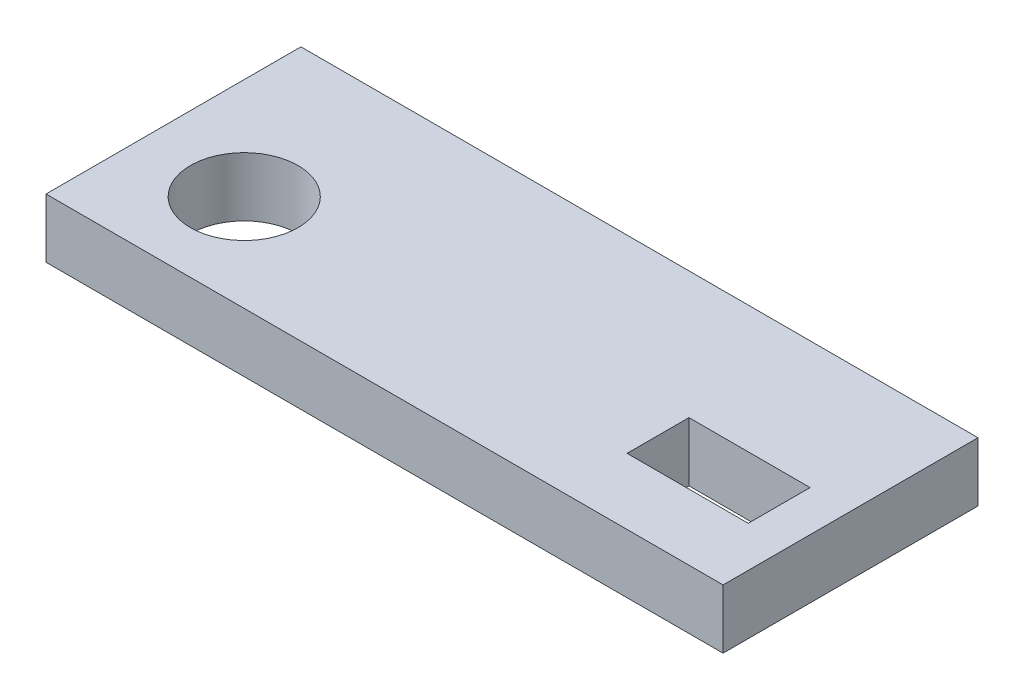
ISO-10303-21;
HEADER;
FILE_DESCRIPTION(('STEP AP214'),'2;1');
FILE_NAME('part.step','',(''),(''),'','','');
FILE_SCHEMA(('AUTOMOTIVE_DESIGN { 1 0 10303 214 1 1 1 1 }'));
ENDSEC;
DATA;
#1=APPLICATION_CONTEXT('core data for automotive mechanical design processes');
#2=APPLICATION_PROTOCOL_DEFINITION('international standard','automotive_design',2000,#1);
#3=PRODUCT_CONTEXT('',#1,'mechanical');
#4=PRODUCT('Part','Part','',(#3));
#5=PRODUCT_RELATED_PRODUCT_CATEGORY('part','',(#4));
#6=PRODUCT_DEFINITION_FORMATION('','',#4);
#7=PRODUCT_DEFINITION_CONTEXT('part definition',#1,'design');
#8=PRODUCT_DEFINITION('design','',#6,#7);
#9=PRODUCT_DEFINITION_SHAPE('','',#8);
#10=(LENGTH_UNIT() NAMED_UNIT(*) SI_UNIT(.MILLI.,.METRE.));
#11=(NAMED_UNIT(*) PLANE_ANGLE_UNIT() SI_UNIT($,.RADIAN.));
#12=(NAMED_UNIT(*) SI_UNIT($,.STERADIAN.) SOLID_ANGLE_UNIT());
#13=UNCERTAINTY_MEASURE_WITH_UNIT(LENGTH_MEASURE(1.E-05),#10,'distance_accuracy_value','');
#14=(GEOMETRIC_REPRESENTATION_CONTEXT(3) GLOBAL_UNCERTAINTY_ASSIGNED_CONTEXT((#13)) GLOBAL_UNIT_ASSIGNED_CONTEXT((#10,
#11,#12)) REPRESENTATION_CONTEXT('',''));
#15=CARTESIAN_POINT('',(0.,0.,0.));
#16=DIRECTION('',(0.,0.,1.));
#17=DIRECTION('',(1.,0.,0.));
#18=AXIS2_PLACEMENT_3D('',#15,#16,#17);
#19=CARTESIAN_POINT('',(0.,0.,25.000000038));
#20=DIRECTION('',(0.,0.,1.));
#21=DIRECTION('',(1.,0.,0.));
#22=AXIS2_PLACEMENT_3D('',#19,#20,#21);
#23=PLANE('',#22);
#24=DIRECTION('',(0.,1.,0.));
#25=VECTOR('',#24,1.);
#26=CARTESIAN_POINT('',(-33.2,-62.5,25.000000038));
#27=LINE('',#26,#25);
#28=CARTESIAN_POINT('',(-33.2,-62.5,25.000000038));
#29=VERTEX_POINT('',#28);
#30=CARTESIAN_POINT('',(-33.2,-56.7,25.000000038));
#31=VERTEX_POINT('',#30);
#32=EDGE_CURVE('E40',#29,#31,#27,.T.);
#33=ORIENTED_EDGE('',*,*,#32,.F.);
#34=DIRECTION('',(1.,0.,0.));
#35=VECTOR('',#34,1.);
#36=CARTESIAN_POINT('',(-33.2,-62.5,25.000000038));
#37=LINE('',#36,#35);
#38=CARTESIAN_POINT('',(33.2,-62.5,25.000000038));
#39=VERTEX_POINT('',#38);
#40=EDGE_CURVE('E130',#29,#39,#37,.T.);
#41=ORIENTED_EDGE('',*,*,#40,.T.);
#42=DIRECTION('',(0.,1.,0.));
#43=VECTOR('',#42,1.);
#44=CARTESIAN_POINT('',(33.2,-62.5,25.000000038));
#45=LINE('',#44,#43);
#46=CARTESIAN_POINT('',(33.2,-56.7,25.000000038));
#47=VERTEX_POINT('',#46);
#48=EDGE_CURVE('E154',#39,#47,#45,.T.);
#49=ORIENTED_EDGE('',*,*,#48,.T.);
#50=DIRECTION('',(1.,0.,0.));
#51=VECTOR('',#50,1.);
#52=CARTESIAN_POINT('',(-33.2,-56.7,25.000000038));
#53=LINE('',#52,#51);
#54=EDGE_CURVE('E150',#31,#47,#53,.T.);
#55=ORIENTED_EDGE('',*,*,#54,.F.);
#56=EDGE_LOOP('',(#33,#41,#49,#55));
#57=FACE_BOUND('',#56,.T.);
#58=ADVANCED_FACE('F33',(#57),#23,.T.);
#59=CARTESIAN_POINT('',(0.,0.,0.));
#60=DIRECTION('',(0.,0.,-1.));
#61=DIRECTION('',(-1.,0.,0.));
#62=AXIS2_PLACEMENT_3D('',#59,#60,#61);
#63=PLANE('',#62);
#64=DIRECTION('',(0.,1.,0.));
#65=VECTOR('',#64,1.);
#66=CARTESIAN_POINT('',(-33.2,-62.5,0.));
#67=LINE('',#66,#65);
#68=CARTESIAN_POINT('',(-33.2,-62.5,0.));
#69=VERTEX_POINT('',#68);
#70=CARTESIAN_POINT('',(-33.2,-56.7,0.));
#71=VERTEX_POINT('',#70);
#72=EDGE_CURVE('E151',#69,#71,#67,.T.);
#73=ORIENTED_EDGE('',*,*,#72,.T.);
#74=DIRECTION('',(1.,0.,0.));
#75=VECTOR('',#74,1.);
#76=CARTESIAN_POINT('',(-33.2,-56.7,0.));
#77=LINE('',#76,#75);
#78=CARTESIAN_POINT('',(33.2,-56.7,0.));
#79=VERTEX_POINT('',#78);
#80=EDGE_CURVE('E147',#71,#79,#77,.T.);
#81=ORIENTED_EDGE('',*,*,#80,.T.);
#82=DIRECTION('',(0.,1.,0.));
#83=VECTOR('',#82,1.);
#84=CARTESIAN_POINT('',(33.2,-62.5,0.));
#85=LINE('',#84,#83);
#86=CARTESIAN_POINT('',(33.2,-62.5,0.));
#87=VERTEX_POINT('',#86);
#88=EDGE_CURVE('E143',#87,#79,#85,.T.);
#89=ORIENTED_EDGE('',*,*,#88,.F.);
#90=DIRECTION('',(1.,0.,0.));
#91=VECTOR('',#90,1.);
#92=CARTESIAN_POINT('',(-33.2,-62.5,0.));
#93=LINE('',#92,#91);
#94=EDGE_CURVE('E139',#69,#87,#93,.T.);
#95=ORIENTED_EDGE('',*,*,#94,.F.);
#96=EDGE_LOOP('',(#73,#81,#89,#95));
#97=FACE_BOUND('',#96,.T.);
#98=ADVANCED_FACE('F175',(#97),#63,.T.);
#99=CARTESIAN_POINT('',(-33.2,-56.7,91.6528319358271));
#100=DIRECTION('',(0.,1.,0.));
#101=DIRECTION('',(0.,0.,1.));
#102=AXIS2_PLACEMENT_3D('',#99,#100,#101);
#103=PLANE('',#102);
#104=DIRECTION('',(0.,0.,1.));
#105=VECTOR('',#104,1.);
#106=CARTESIAN_POINT('',(17.32,-56.7,18.535000019));
#107=LINE('',#106,#105);
#108=CARTESIAN_POINT('',(17.32,-56.7,12.465000019));
#109=VERTEX_POINT('',#108);
#110=CARTESIAN_POINT('',(17.32,-56.7,18.535000019));
#111=VERTEX_POINT('',#110);
#112=EDGE_CURVE('E47',#109,#111,#107,.T.);
#113=ORIENTED_EDGE('',*,*,#112,.F.);
#114=DIRECTION('',(-1.,0.,0.));
#115=VECTOR('',#114,1.);
#116=CARTESIAN_POINT('',(29.2,-56.7,12.465000019));
#117=LINE('',#116,#115);
#118=CARTESIAN_POINT('',(29.2,-56.7,12.465000019));
#119=VERTEX_POINT('',#118);
#120=EDGE_CURVE('E114',#119,#109,#117,.T.);
#121=ORIENTED_EDGE('',*,*,#120,.F.);
#122=DIRECTION('',(0.,0.,-1.));
#123=VECTOR('',#122,1.);
#124=CARTESIAN_POINT('',(29.2,-56.7,18.535000019));
#125=LINE('',#124,#123);
#126=CARTESIAN_POINT('',(29.2,-56.7,18.535000019));
#127=VERTEX_POINT('',#126);
#128=EDGE_CURVE('E117',#127,#119,#125,.T.);
#129=ORIENTED_EDGE('',*,*,#128,.F.);
#130=DIRECTION('',(1.,0.,0.));
#131=VECTOR('',#130,1.);
#132=CARTESIAN_POINT('',(29.2,-56.7,18.535000019));
#133=LINE('',#132,#131);
#134=EDGE_CURVE('E123',#111,#127,#133,.T.);
#135=ORIENTED_EDGE('',*,*,#134,.F.);
#136=EDGE_LOOP('',(#113,#121,#129,#135));
#137=FACE_BOUND('',#136,.T.);
#138=CARTESIAN_POINT('',(-23.26,-56.7,15.500000019));
#139=DIRECTION('',(0.,1.,0.));
#140=DIRECTION('',(0.,0.,1.));
#141=AXIS2_PLACEMENT_3D('',#138,#139,#140);
#142=CIRCLE('',#141,5.28);
#143=CARTESIAN_POINT('',(-23.26,-56.7,20.780000019));
#144=VERTEX_POINT('',#143);
#145=EDGE_CURVE('E136',#144,#144,#142,.T.);
#146=ORIENTED_EDGE('',*,*,#145,.F.);
#147=EDGE_LOOP('',(#146));
#148=FACE_BOUND('',#147,.T.);
#149=DIRECTION('',(0.,0.,-1.));
#150=VECTOR('',#149,1.);
#151=CARTESIAN_POINT('',(-33.2,-56.7,91.6528319358271));
#152=LINE('',#151,#150);
#153=EDGE_CURVE('E11',#31,#71,#152,.T.);
#154=ORIENTED_EDGE('',*,*,#153,.F.);
#155=ORIENTED_EDGE('',*,*,#54,.T.);
#156=DIRECTION('',(0.,0.,-1.));
#157=VECTOR('',#156,1.);
#158=CARTESIAN_POINT('',(33.2,-56.7,91.6528319358271));
#159=LINE('',#158,#157);
#160=EDGE_CURVE('E157',#47,#79,#159,.T.);
#161=ORIENTED_EDGE('',*,*,#160,.T.);
#162=ORIENTED_EDGE('',*,*,#80,.F.);
#163=EDGE_LOOP('',(#154,#155,#161,#162));
#164=FACE_BOUND('',#163,.T.);
#165=ADVANCED_FACE('F167',(#137,#148,#164),#103,.T.);
#166=CARTESIAN_POINT('',(33.2,-62.5,91.6528319358271));
#167=DIRECTION('',(-1.,0.,0.));
#168=DIRECTION('',(0.,0.,1.));
#169=AXIS2_PLACEMENT_3D('',#166,#167,#168);
#170=PLANE('',#169);
#171=ORIENTED_EDGE('',*,*,#48,.F.);
#172=DIRECTION('',(0.,0.,-1.));
#173=VECTOR('',#172,1.);
#174=CARTESIAN_POINT('',(33.2,-62.5,91.6528319358271));
#175=LINE('',#174,#173);
#176=EDGE_CURVE('E146',#39,#87,#175,.T.);
#177=ORIENTED_EDGE('',*,*,#176,.T.);
#178=ORIENTED_EDGE('',*,*,#88,.T.);
#179=ORIENTED_EDGE('',*,*,#160,.F.);
#180=EDGE_LOOP('',(#171,#177,#178,#179));
#181=FACE_BOUND('',#180,.T.);
#182=ADVANCED_FACE('F171',(#181),#170,.F.);
#183=CARTESIAN_POINT('',(-33.2,-62.5,91.6528319358271));
#184=DIRECTION('',(0.,1.,0.));
#185=DIRECTION('',(0.,0.,1.));
#186=AXIS2_PLACEMENT_3D('',#183,#184,#185);
#187=PLANE('',#186);
#188=DIRECTION('',(-1.,0.,0.));
#189=VECTOR('',#188,1.);
#190=CARTESIAN_POINT('',(29.2,-62.5,12.465000019));
#191=LINE('',#190,#189);
#192=CARTESIAN_POINT('',(29.2,-62.5,12.465000019));
#193=VERTEX_POINT('',#192);
#194=CARTESIAN_POINT('',(17.32,-62.5,12.465000019));
#195=VERTEX_POINT('',#194);
#196=EDGE_CURVE('E104',#193,#195,#191,.T.);
#197=ORIENTED_EDGE('',*,*,#196,.T.);
#198=DIRECTION('',(0.,0.,1.));
#199=VECTOR('',#198,1.);
#200=CARTESIAN_POINT('',(17.32,-62.5,18.535000019));
#201=LINE('',#200,#199);
#202=CARTESIAN_POINT('',(17.32,-62.5,18.535000019));
#203=VERTEX_POINT('',#202);
#204=EDGE_CURVE('E98',#195,#203,#201,.T.);
#205=ORIENTED_EDGE('',*,*,#204,.T.);
#206=DIRECTION('',(1.,0.,0.));
#207=VECTOR('',#206,1.);
#208=CARTESIAN_POINT('',(29.2,-62.5,18.535000019));
#209=LINE('',#208,#207);
#210=CARTESIAN_POINT('',(29.2,-62.5,18.535000019));
#211=VERTEX_POINT('',#210);
#212=EDGE_CURVE('E107',#203,#211,#209,.T.);
#213=ORIENTED_EDGE('',*,*,#212,.T.);
#214=DIRECTION('',(0.,0.,-1.));
#215=VECTOR('',#214,1.);
#216=CARTESIAN_POINT('',(29.2,-62.5,18.535000019));
#217=LINE('',#216,#215);
#218=EDGE_CURVE('E55',#211,#193,#217,.T.);
#219=ORIENTED_EDGE('',*,*,#218,.T.);
#220=EDGE_LOOP('',(#197,#205,#213,#219));
#221=FACE_BOUND('',#220,.T.);
#222=CARTESIAN_POINT('',(-23.26,-62.5,15.500000019));
#223=DIRECTION('',(0.,1.,0.));
#224=DIRECTION('',(0.,0.,1.));
#225=AXIS2_PLACEMENT_3D('',#222,#223,#224);
#226=CIRCLE('',#225,5.28);
#227=CARTESIAN_POINT('',(-23.26,-62.5,20.780000019));
#228=VERTEX_POINT('',#227);
#229=EDGE_CURVE('E124',#228,#228,#226,.T.);
#230=ORIENTED_EDGE('',*,*,#229,.T.);
#231=EDGE_LOOP('',(#230));
#232=FACE_BOUND('',#231,.T.);
#233=ORIENTED_EDGE('',*,*,#40,.F.);
#234=DIRECTION('',(0.,0.,-1.));
#235=VECTOR('',#234,1.);
#236=CARTESIAN_POINT('',(-33.2,-62.5,91.6528319358271));
#237=LINE('',#236,#235);
#238=EDGE_CURVE('E142',#29,#69,#237,.T.);
#239=ORIENTED_EDGE('',*,*,#238,.T.);
#240=ORIENTED_EDGE('',*,*,#94,.T.);
#241=ORIENTED_EDGE('',*,*,#176,.F.);
#242=EDGE_LOOP('',(#233,#239,#240,#241));
#243=FACE_BOUND('',#242,.T.);
#244=ADVANCED_FACE('F111',(#221,#232,#243),#187,.F.);
#245=CARTESIAN_POINT('',(-33.2,-62.5,91.6528319358271));
#246=DIRECTION('',(-1.,0.,0.));
#247=DIRECTION('',(0.,0.,1.));
#248=AXIS2_PLACEMENT_3D('',#245,#246,#247);
#249=PLANE('',#248);
#250=ORIENTED_EDGE('',*,*,#238,.F.);
#251=ORIENTED_EDGE('',*,*,#32,.T.);
#252=ORIENTED_EDGE('',*,*,#153,.T.);
#253=ORIENTED_EDGE('',*,*,#72,.F.);
#254=EDGE_LOOP('',(#250,#251,#252,#253));
#255=FACE_BOUND('',#254,.T.);
#256=ADVANCED_FACE('F179',(#255),#249,.T.);
#257=CARTESIAN_POINT('',(-23.26,-62.5,15.500000019));
#258=DIRECTION('',(0.,1.,0.));
#259=DIRECTION('',(0.,0.,1.));
#260=AXIS2_PLACEMENT_3D('',#257,#258,#259);
#261=CYLINDRICAL_SURFACE('',#260,5.28);
#262=ORIENTED_EDGE('',*,*,#229,.F.);
#263=EDGE_LOOP('',(#262));
#264=FACE_BOUND('',#263,.T.);
#265=ORIENTED_EDGE('',*,*,#145,.T.);
#266=EDGE_LOOP('',(#265));
#267=FACE_BOUND('',#266,.T.);
#268=ADVANCED_FACE('F189',(#264,#267),#261,.F.);
#269=CARTESIAN_POINT('',(17.32,-62.5,18.535000019));
#270=DIRECTION('',(-1.,0.,0.));
#271=DIRECTION('',(0.,0.,1.));
#272=AXIS2_PLACEMENT_3D('',#269,#270,#271);
#273=PLANE('',#272);
#274=ORIENTED_EDGE('',*,*,#112,.T.);
#275=DIRECTION('',(0.,1.,0.));
#276=VECTOR('',#275,1.);
#277=CARTESIAN_POINT('',(17.32,-62.5,18.535000019));
#278=LINE('',#277,#276);
#279=EDGE_CURVE('E94',#203,#111,#278,.T.);
#280=ORIENTED_EDGE('',*,*,#279,.F.);
#281=ORIENTED_EDGE('',*,*,#204,.F.);
#282=DIRECTION('',(0.,1.,0.));
#283=VECTOR('',#282,1.);
#284=CARTESIAN_POINT('',(17.32,-62.5,12.465000019));
#285=LINE('',#284,#283);
#286=EDGE_CURVE('E128',#195,#109,#285,.T.);
#287=ORIENTED_EDGE('',*,*,#286,.T.);
#288=EDGE_LOOP('',(#274,#280,#281,#287));
#289=FACE_BOUND('',#288,.T.);
#290=ADVANCED_FACE('F96',(#289),#273,.F.);
#291=CARTESIAN_POINT('',(29.2,-62.5,12.465000019));
#292=DIRECTION('',(0.,0.,-1.));
#293=DIRECTION('',(-1.,0.,0.));
#294=AXIS2_PLACEMENT_3D('',#291,#292,#293);
#295=PLANE('',#294);
#296=ORIENTED_EDGE('',*,*,#120,.T.);
#297=ORIENTED_EDGE('',*,*,#286,.F.);
#298=ORIENTED_EDGE('',*,*,#196,.F.);
#299=DIRECTION('',(0.,1.,0.));
#300=VECTOR('',#299,1.);
#301=CARTESIAN_POINT('',(29.2,-62.5,12.465000019));
#302=LINE('',#301,#300);
#303=EDGE_CURVE('E131',#193,#119,#302,.T.);
#304=ORIENTED_EDGE('',*,*,#303,.T.);
#305=EDGE_LOOP('',(#296,#297,#298,#304));
#306=FACE_BOUND('',#305,.T.);
#307=ADVANCED_FACE('F207',(#306),#295,.F.);
#308=CARTESIAN_POINT('',(29.2,-62.5,18.535000019));
#309=DIRECTION('',(1.,0.,0.));
#310=DIRECTION('',(0.,0.,-1.));
#311=AXIS2_PLACEMENT_3D('',#308,#309,#310);
#312=PLANE('',#311);
#313=ORIENTED_EDGE('',*,*,#128,.T.);
#314=ORIENTED_EDGE('',*,*,#303,.F.);
#315=ORIENTED_EDGE('',*,*,#218,.F.);
#316=DIRECTION('',(0.,1.,0.));
#317=VECTOR('',#316,1.);
#318=CARTESIAN_POINT('',(29.2,-62.5,18.535000019));
#319=LINE('',#318,#317);
#320=EDGE_CURVE('E103',#211,#127,#319,.T.);
#321=ORIENTED_EDGE('',*,*,#320,.T.);
#322=EDGE_LOOP('',(#313,#314,#315,#321));
#323=FACE_BOUND('',#322,.T.);
#324=ADVANCED_FACE('F210',(#323),#312,.F.);
#325=CARTESIAN_POINT('',(29.2,-62.5,18.535000019));
#326=DIRECTION('',(0.,0.,1.));
#327=DIRECTION('',(1.,0.,0.));
#328=AXIS2_PLACEMENT_3D('',#325,#326,#327);
#329=PLANE('',#328);
#330=ORIENTED_EDGE('',*,*,#134,.T.);
#331=ORIENTED_EDGE('',*,*,#320,.F.);
#332=ORIENTED_EDGE('',*,*,#212,.F.);
#333=ORIENTED_EDGE('',*,*,#279,.T.);
#334=EDGE_LOOP('',(#330,#331,#332,#333));
#335=FACE_BOUND('',#334,.T.);
#336=ADVANCED_FACE('F108',(#335),#329,.F.);
#337=CLOSED_SHELL('',(#58,#98,#165,#182,#244,#256,#268,#290,#307,#324,#336));
#338=MANIFOLD_SOLID_BREP('B2',#337);
#339=ADVANCED_BREP_SHAPE_REPRESENTATION('',(#18,#338),#14);
#340=SHAPE_DEFINITION_REPRESENTATION(#9,#339);
ENDSEC;
END-ISO-10303-21;
